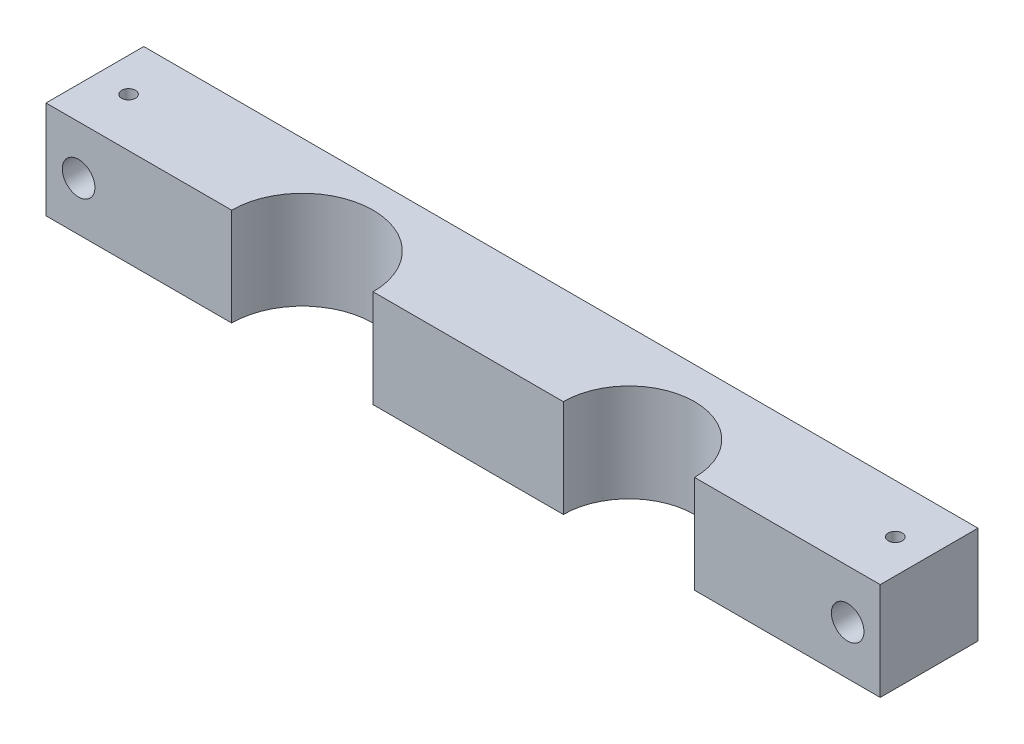
ISO-10303-21;
HEADER;
FILE_DESCRIPTION(('STEP AP214'),'2;1');
FILE_NAME('part.step','',(''),(''),'','','');
FILE_SCHEMA(('AUTOMOTIVE_DESIGN { 1 0 10303 214 1 1 1 1 }'));
ENDSEC;
DATA;
#1=APPLICATION_CONTEXT('core data for automotive mechanical design processes');
#2=APPLICATION_PROTOCOL_DEFINITION('international standard','automotive_design',2000,#1);
#3=PRODUCT_CONTEXT('',#1,'mechanical');
#4=PRODUCT('Part','Part','',(#3));
#5=PRODUCT_RELATED_PRODUCT_CATEGORY('part','',(#4));
#6=PRODUCT_DEFINITION_FORMATION('','',#4);
#7=PRODUCT_DEFINITION_CONTEXT('part definition',#1,'design');
#8=PRODUCT_DEFINITION('design','',#6,#7);
#9=PRODUCT_DEFINITION_SHAPE('','',#8);
#10=(LENGTH_UNIT() NAMED_UNIT(*) SI_UNIT(.MILLI.,.METRE.));
#11=(NAMED_UNIT(*) PLANE_ANGLE_UNIT() SI_UNIT($,.RADIAN.));
#12=(NAMED_UNIT(*) SI_UNIT($,.STERADIAN.) SOLID_ANGLE_UNIT());
#13=UNCERTAINTY_MEASURE_WITH_UNIT(LENGTH_MEASURE(1.E-05),#10,'distance_accuracy_value','');
#14=(GEOMETRIC_REPRESENTATION_CONTEXT(3) GLOBAL_UNCERTAINTY_ASSIGNED_CONTEXT((#13)) GLOBAL_UNIT_ASSIGNED_CONTEXT((#10,
#11,#12)) REPRESENTATION_CONTEXT('',''));
#15=CARTESIAN_POINT('',(0.,0.,0.));
#16=DIRECTION('',(0.,0.,1.));
#17=DIRECTION('',(1.,0.,0.));
#18=AXIS2_PLACEMENT_3D('',#15,#16,#17);
#19=CARTESIAN_POINT('',(0.,19.05,0.));
#20=DIRECTION('',(0.,0.,-1.));
#21=DIRECTION('',(-1.,0.,0.));
#22=AXIS2_PLACEMENT_3D('',#19,#20,#21);
#23=PLANE('',#22);
#24=CARTESIAN_POINT('',(6.35000000000001,9.525,0.));
#25=DIRECTION('',(0.,0.,1.));
#26=DIRECTION('',(1.,0.,0.));
#27=AXIS2_PLACEMENT_3D('',#24,#25,#26);
#28=CIRCLE('',#27,3.175);
#29=CARTESIAN_POINT('',(9.52500000000001,9.525,0.));
#30=VERTEX_POINT('',#29);
#31=EDGE_CURVE('E191',#30,#30,#28,.T.);
#32=ORIENTED_EDGE('',*,*,#31,.F.);
#33=EDGE_LOOP('',(#32));
#34=FACE_BOUND('',#33,.T.);
#35=DIRECTION('',(1.,0.,0.));
#36=VECTOR('',#35,1.);
#37=CARTESIAN_POINT('',(0.,0.,0.));
#38=LINE('',#37,#36);
#39=CARTESIAN_POINT('',(0.,0.,0.));
#40=VERTEX_POINT('',#39);
#41=CARTESIAN_POINT('',(36.17595,0.,0.));
#42=VERTEX_POINT('',#41);
#43=EDGE_CURVE('E131',#40,#42,#38,.T.);
#44=ORIENTED_EDGE('',*,*,#43,.T.);
#45=DIRECTION('',(0.,-1.,0.));
#46=VECTOR('',#45,1.);
#47=CARTESIAN_POINT('',(36.17595,19.05,0.));
#48=LINE('',#47,#46);
#49=CARTESIAN_POINT('',(36.17595,19.05,0.));
#50=VERTEX_POINT('',#49);
#51=EDGE_CURVE('E11',#50,#42,#48,.T.);
#52=ORIENTED_EDGE('',*,*,#51,.F.);
#53=DIRECTION('',(1.,0.,0.));
#54=VECTOR('',#53,1.);
#55=CARTESIAN_POINT('',(0.,19.05,0.));
#56=LINE('',#55,#54);
#57=CARTESIAN_POINT('',(0.,19.05,0.));
#58=VERTEX_POINT('',#57);
#59=EDGE_CURVE('E88',#58,#50,#56,.T.);
#60=ORIENTED_EDGE('',*,*,#59,.F.);
#61=DIRECTION('',(0.,-1.,0.));
#62=VECTOR('',#61,1.);
#63=CARTESIAN_POINT('',(0.,19.05,0.));
#64=LINE('',#63,#62);
#65=EDGE_CURVE('E51',#58,#40,#64,.T.);
#66=ORIENTED_EDGE('',*,*,#65,.T.);
#67=EDGE_LOOP('',(#44,#52,#60,#66));
#68=FACE_BOUND('',#67,.T.);
#69=ADVANCED_FACE('F35',(#34,#68),#23,.F.);
#70=CARTESIAN_POINT('',(49.95545,19.05,0.));
#71=DIRECTION('',(0.,-1.,0.));
#72=DIRECTION('',(0.,0.,-1.));
#73=AXIS2_PLACEMENT_3D('',#70,#71,#72);
#74=CYLINDRICAL_SURFACE('',#73,13.7795);
#75=CARTESIAN_POINT('',(49.95545,0.,0.));
#76=DIRECTION('',(0.,1.,0.));
#77=DIRECTION('',(0.,0.,1.));
#78=AXIS2_PLACEMENT_3D('',#75,#76,#77);
#79=CIRCLE('',#78,13.7795);
#80=CARTESIAN_POINT('',(63.73495,0.,0.));
#81=VERTEX_POINT('',#80);
#82=EDGE_CURVE('E133',#81,#42,#79,.T.);
#83=ORIENTED_EDGE('',*,*,#82,.F.);
#84=DIRECTION('',(0.,-1.,0.));
#85=VECTOR('',#84,1.);
#86=CARTESIAN_POINT('',(63.73495,19.05,0.));
#87=LINE('',#86,#85);
#88=CARTESIAN_POINT('',(63.73495,19.05,0.));
#89=VERTEX_POINT('',#88);
#90=EDGE_CURVE('E43',#89,#81,#87,.T.);
#91=ORIENTED_EDGE('',*,*,#90,.F.);
#92=CARTESIAN_POINT('',(49.95545,19.05,0.));
#93=DIRECTION('',(0.,1.,0.));
#94=DIRECTION('',(0.,0.,1.));
#95=AXIS2_PLACEMENT_3D('',#92,#93,#94);
#96=CIRCLE('',#95,13.7795);
#97=EDGE_CURVE('E171',#89,#50,#96,.T.);
#98=ORIENTED_EDGE('',*,*,#97,.T.);
#99=ORIENTED_EDGE('',*,*,#51,.T.);
#100=EDGE_LOOP('',(#83,#91,#98,#99));
#101=FACE_BOUND('',#100,.T.);
#102=ADVANCED_FACE('F170',(#101),#74,.F.);
#103=CARTESIAN_POINT('',(63.73495,19.05,0.));
#104=DIRECTION('',(0.,0.,-1.));
#105=DIRECTION('',(-1.,0.,0.));
#106=AXIS2_PLACEMENT_3D('',#103,#104,#105);
#107=PLANE('',#106);
#108=DIRECTION('',(1.,0.,0.));
#109=VECTOR('',#108,1.);
#110=CARTESIAN_POINT('',(63.73495,0.,0.));
#111=LINE('',#110,#109);
#112=CARTESIAN_POINT('',(100.80625,0.,0.));
#113=VERTEX_POINT('',#112);
#114=EDGE_CURVE('E137',#81,#113,#111,.T.);
#115=ORIENTED_EDGE('',*,*,#114,.T.);
#116=DIRECTION('',(0.,-1.,0.));
#117=VECTOR('',#116,1.);
#118=CARTESIAN_POINT('',(100.80625,19.05,0.));
#119=LINE('',#118,#117);
#120=CARTESIAN_POINT('',(100.80625,19.05,0.));
#121=VERTEX_POINT('',#120);
#122=EDGE_CURVE('E156',#121,#113,#119,.T.);
#123=ORIENTED_EDGE('',*,*,#122,.F.);
#124=DIRECTION('',(1.,0.,0.));
#125=VECTOR('',#124,1.);
#126=CARTESIAN_POINT('',(63.73495,19.05,0.));
#127=LINE('',#126,#125);
#128=EDGE_CURVE('E162',#89,#121,#127,.T.);
#129=ORIENTED_EDGE('',*,*,#128,.F.);
#130=ORIENTED_EDGE('',*,*,#90,.T.);
#131=EDGE_LOOP('',(#115,#123,#129,#130));
#132=FACE_BOUND('',#131,.T.);
#133=ADVANCED_FACE('F160',(#132),#107,.F.);
#134=CARTESIAN_POINT('',(113.59515,19.05,0.));
#135=DIRECTION('',(0.,-1.,0.));
#136=DIRECTION('',(0.,0.,-1.));
#137=AXIS2_PLACEMENT_3D('',#134,#135,#136);
#138=CYLINDRICAL_SURFACE('',#137,12.7889);
#139=CARTESIAN_POINT('',(113.59515,0.,0.));
#140=DIRECTION('',(0.,1.,0.));
#141=DIRECTION('',(0.,0.,1.));
#142=AXIS2_PLACEMENT_3D('',#139,#140,#141);
#143=CIRCLE('',#142,12.7889);
#144=CARTESIAN_POINT('',(126.38405,0.,0.));
#145=VERTEX_POINT('',#144);
#146=EDGE_CURVE('E140',#145,#113,#143,.T.);
#147=ORIENTED_EDGE('',*,*,#146,.F.);
#148=DIRECTION('',(0.,-1.,0.));
#149=VECTOR('',#148,1.);
#150=CARTESIAN_POINT('',(126.38405,19.05,0.));
#151=LINE('',#150,#149);
#152=CARTESIAN_POINT('',(126.38405,19.05,0.));
#153=VERTEX_POINT('',#152);
#154=EDGE_CURVE('E154',#153,#145,#151,.T.);
#155=ORIENTED_EDGE('',*,*,#154,.F.);
#156=CARTESIAN_POINT('',(113.59515,19.05,0.));
#157=DIRECTION('',(0.,1.,0.));
#158=DIRECTION('',(0.,0.,1.));
#159=AXIS2_PLACEMENT_3D('',#156,#157,#158);
#160=CIRCLE('',#159,12.7889);
#161=EDGE_CURVE('E209',#153,#121,#160,.T.);
#162=ORIENTED_EDGE('',*,*,#161,.T.);
#163=ORIENTED_EDGE('',*,*,#122,.T.);
#164=EDGE_LOOP('',(#147,#155,#162,#163));
#165=FACE_BOUND('',#164,.T.);
#166=ADVANCED_FACE('F212',(#165),#138,.F.);
#167=CARTESIAN_POINT('',(126.38405,19.05,0.));
#168=DIRECTION('',(0.,0.,-1.));
#169=DIRECTION('',(-1.,0.,0.));
#170=AXIS2_PLACEMENT_3D('',#167,#168,#169);
#171=PLANE('',#170);
#172=CARTESIAN_POINT('',(156.21,9.525,0.));
#173=DIRECTION('',(0.,0.,1.));
#174=DIRECTION('',(1.,0.,0.));
#175=AXIS2_PLACEMENT_3D('',#172,#173,#174);
#176=CIRCLE('',#175,3.17500000000001);
#177=CARTESIAN_POINT('',(159.385,9.525,0.));
#178=VERTEX_POINT('',#177);
#179=EDGE_CURVE('E331',#178,#178,#176,.T.);
#180=ORIENTED_EDGE('',*,*,#179,.F.);
#181=EDGE_LOOP('',(#180));
#182=FACE_BOUND('',#181,.T.);
#183=DIRECTION('',(1.,0.,0.));
#184=VECTOR('',#183,1.);
#185=CARTESIAN_POINT('',(126.38405,0.,0.));
#186=LINE('',#185,#184);
#187=CARTESIAN_POINT('',(162.56,0.,0.));
#188=VERTEX_POINT('',#187);
#189=EDGE_CURVE('E143',#145,#188,#186,.T.);
#190=ORIENTED_EDGE('',*,*,#189,.T.);
#191=DIRECTION('',(0.,-1.,0.));
#192=VECTOR('',#191,1.);
#193=CARTESIAN_POINT('',(162.56,19.05,0.));
#194=LINE('',#193,#192);
#195=CARTESIAN_POINT('',(162.56,19.05,0.));
#196=VERTEX_POINT('',#195);
#197=EDGE_CURVE('E123',#196,#188,#194,.T.);
#198=ORIENTED_EDGE('',*,*,#197,.F.);
#199=DIRECTION('',(1.,0.,0.));
#200=VECTOR('',#199,1.);
#201=CARTESIAN_POINT('',(126.38405,19.05,0.));
#202=LINE('',#201,#200);
#203=EDGE_CURVE('E111',#153,#196,#202,.T.);
#204=ORIENTED_EDGE('',*,*,#203,.F.);
#205=ORIENTED_EDGE('',*,*,#154,.T.);
#206=EDGE_LOOP('',(#190,#198,#204,#205));
#207=FACE_BOUND('',#206,.T.);
#208=ADVANCED_FACE('F214',(#182,#207),#171,.F.);
#209=CARTESIAN_POINT('',(162.56,19.05,0.));
#210=DIRECTION('',(-1.,0.,0.));
#211=DIRECTION('',(0.,0.,1.));
#212=AXIS2_PLACEMENT_3D('',#209,#210,#211);
#213=PLANE('',#212);
#214=DIRECTION('',(0.,0.,-1.));
#215=VECTOR('',#214,1.);
#216=CARTESIAN_POINT('',(162.56,0.,0.));
#217=LINE('',#216,#215);
#218=CARTESIAN_POINT('',(162.56,0.,-19.05));
#219=VERTEX_POINT('',#218);
#220=EDGE_CURVE('E120',#188,#219,#217,.T.);
#221=ORIENTED_EDGE('',*,*,#220,.T.);
#222=DIRECTION('',(0.,-1.,0.));
#223=VECTOR('',#222,1.);
#224=CARTESIAN_POINT('',(162.56,19.05,-19.05));
#225=LINE('',#224,#223);
#226=CARTESIAN_POINT('',(162.56,19.05,-19.05));
#227=VERTEX_POINT('',#226);
#228=EDGE_CURVE('E117',#227,#219,#225,.T.);
#229=ORIENTED_EDGE('',*,*,#228,.F.);
#230=DIRECTION('',(0.,0.,-1.));
#231=VECTOR('',#230,1.);
#232=CARTESIAN_POINT('',(162.56,19.05,0.));
#233=LINE('',#232,#231);
#234=EDGE_CURVE('E104',#196,#227,#233,.T.);
#235=ORIENTED_EDGE('',*,*,#234,.F.);
#236=ORIENTED_EDGE('',*,*,#197,.T.);
#237=EDGE_LOOP('',(#221,#229,#235,#236));
#238=FACE_BOUND('',#237,.T.);
#239=ADVANCED_FACE('F118',(#238),#213,.F.);
#240=CARTESIAN_POINT('',(0.,19.05,-19.05));
#241=DIRECTION('',(0.,0.,-1.));
#242=DIRECTION('',(-1.,0.,0.));
#243=AXIS2_PLACEMENT_3D('',#240,#241,#242);
#244=PLANE('',#243);
#245=CARTESIAN_POINT('',(156.21,9.525,-19.05));
#246=DIRECTION('',(0.,0.,1.));
#247=DIRECTION('',(1.,0.,0.));
#248=AXIS2_PLACEMENT_3D('',#245,#246,#247);
#249=CIRCLE('',#248,3.17499999999998);
#250=CARTESIAN_POINT('',(159.385,9.525,-19.05));
#251=VERTEX_POINT('',#250);
#252=EDGE_CURVE('E335',#251,#251,#249,.T.);
#253=ORIENTED_EDGE('',*,*,#252,.T.);
#254=EDGE_LOOP('',(#253));
#255=FACE_BOUND('',#254,.T.);
#256=CARTESIAN_POINT('',(6.35000000000001,9.525,-19.05));
#257=DIRECTION('',(0.,0.,1.));
#258=DIRECTION('',(1.,0.,0.));
#259=AXIS2_PLACEMENT_3D('',#256,#257,#258);
#260=CIRCLE('',#259,3.175);
#261=CARTESIAN_POINT('',(9.525,9.525,-19.05));
#262=VERTEX_POINT('',#261);
#263=EDGE_CURVE('E134',#262,#262,#260,.T.);
#264=ORIENTED_EDGE('',*,*,#263,.T.);
#265=EDGE_LOOP('',(#264));
#266=FACE_BOUND('',#265,.T.);
#267=DIRECTION('',(1.,0.,0.));
#268=VECTOR('',#267,1.);
#269=CARTESIAN_POINT('',(0.,0.,-19.05));
#270=LINE('',#269,#268);
#271=CARTESIAN_POINT('',(0.,0.,-19.05));
#272=VERTEX_POINT('',#271);
#273=EDGE_CURVE('E146',#272,#219,#270,.T.);
#274=ORIENTED_EDGE('',*,*,#273,.F.);
#275=DIRECTION('',(0.,-1.,0.));
#276=VECTOR('',#275,1.);
#277=CARTESIAN_POINT('',(0.,19.05,-19.05));
#278=LINE('',#277,#276);
#279=CARTESIAN_POINT('',(0.,19.05,-19.05));
#280=VERTEX_POINT('',#279);
#281=EDGE_CURVE('E76',#280,#272,#278,.T.);
#282=ORIENTED_EDGE('',*,*,#281,.F.);
#283=DIRECTION('',(1.,0.,0.));
#284=VECTOR('',#283,1.);
#285=CARTESIAN_POINT('',(0.,19.05,-19.05));
#286=LINE('',#285,#284);
#287=EDGE_CURVE('E108',#280,#227,#286,.T.);
#288=ORIENTED_EDGE('',*,*,#287,.T.);
#289=ORIENTED_EDGE('',*,*,#228,.T.);
#290=EDGE_LOOP('',(#274,#282,#288,#289));
#291=FACE_BOUND('',#290,.T.);
#292=ADVANCED_FACE('F125',(#255,#266,#291),#244,.T.);
#293=CARTESIAN_POINT('',(0.,19.05,0.));
#294=DIRECTION('',(-1.,0.,0.));
#295=DIRECTION('',(0.,0.,1.));
#296=AXIS2_PLACEMENT_3D('',#293,#294,#295);
#297=PLANE('',#296);
#298=DIRECTION('',(0.,0.,-1.));
#299=VECTOR('',#298,1.);
#300=CARTESIAN_POINT('',(0.,0.,0.));
#301=LINE('',#300,#299);
#302=EDGE_CURVE('E148',#40,#272,#301,.T.);
#303=ORIENTED_EDGE('',*,*,#302,.F.);
#304=ORIENTED_EDGE('',*,*,#65,.F.);
#305=DIRECTION('',(0.,0.,-1.));
#306=VECTOR('',#305,1.);
#307=CARTESIAN_POINT('',(0.,19.05,0.));
#308=LINE('',#307,#306);
#309=EDGE_CURVE('E126',#58,#280,#308,.T.);
#310=ORIENTED_EDGE('',*,*,#309,.T.);
#311=ORIENTED_EDGE('',*,*,#281,.T.);
#312=EDGE_LOOP('',(#303,#304,#310,#311));
#313=FACE_BOUND('',#312,.T.);
#314=ADVANCED_FACE('F172',(#313),#297,.T.);
#315=CARTESIAN_POINT('',(49.95545,19.05,0.));
#316=DIRECTION('',(0.,1.,0.));
#317=DIRECTION('',(0.,0.,1.));
#318=AXIS2_PLACEMENT_3D('',#315,#316,#317);
#319=PLANE('',#318);
#320=CARTESIAN_POINT('',(155.98107677662,19.05,-9.50876156883329));
#321=DIRECTION('',(0.,1.,0.));
#322=DIRECTION('',(0.,0.,1.));
#323=AXIS2_PLACEMENT_3D('',#320,#321,#322);
#324=CIRCLE('',#323,1.35254999999998);
#325=CARTESIAN_POINT('',(155.98107677662,19.05,-8.15621156883331));
#326=VERTEX_POINT('',#325);
#327=EDGE_CURVE('E332',#326,#326,#324,.T.);
#328=ORIENTED_EDGE('',*,*,#327,.F.);
#329=EDGE_LOOP('',(#328));
#330=FACE_BOUND('',#329,.T.);
#331=CARTESIAN_POINT('',(6.57892322337972,19.05,-9.50876156883329));
#332=DIRECTION('',(0.,1.,0.));
#333=DIRECTION('',(0.,0.,1.));
#334=AXIS2_PLACEMENT_3D('',#331,#332,#333);
#335=CIRCLE('',#334,1.35254999999999);
#336=CARTESIAN_POINT('',(6.57892322337972,19.05,-8.1562115688333));
#337=VERTEX_POINT('',#336);
#338=EDGE_CURVE('E198',#337,#337,#335,.T.);
#339=ORIENTED_EDGE('',*,*,#338,.F.);
#340=EDGE_LOOP('',(#339));
#341=FACE_BOUND('',#340,.T.);
#342=ORIENTED_EDGE('',*,*,#59,.T.);
#343=ORIENTED_EDGE('',*,*,#97,.F.);
#344=ORIENTED_EDGE('',*,*,#128,.T.);
#345=ORIENTED_EDGE('',*,*,#161,.F.);
#346=ORIENTED_EDGE('',*,*,#203,.T.);
#347=ORIENTED_EDGE('',*,*,#234,.T.);
#348=ORIENTED_EDGE('',*,*,#287,.F.);
#349=ORIENTED_EDGE('',*,*,#309,.F.);
#350=EDGE_LOOP('',(#342,#343,#344,#345,#346,#347,#348,#349));
#351=FACE_BOUND('',#350,.T.);
#352=ADVANCED_FACE('F106',(#330,#341,#351),#319,.T.);
#353=CARTESIAN_POINT('',(49.95545,0.,0.));
#354=DIRECTION('',(0.,1.,0.));
#355=DIRECTION('',(0.,0.,1.));
#356=AXIS2_PLACEMENT_3D('',#353,#354,#355);
#357=PLANE('',#356);
#358=ORIENTED_EDGE('',*,*,#43,.F.);
#359=ORIENTED_EDGE('',*,*,#302,.T.);
#360=ORIENTED_EDGE('',*,*,#273,.T.);
#361=ORIENTED_EDGE('',*,*,#220,.F.);
#362=ORIENTED_EDGE('',*,*,#189,.F.);
#363=ORIENTED_EDGE('',*,*,#146,.T.);
#364=ORIENTED_EDGE('',*,*,#114,.F.);
#365=ORIENTED_EDGE('',*,*,#82,.T.);
#366=EDGE_LOOP('',(#358,#359,#360,#361,#362,#363,#364,#365));
#367=FACE_BOUND('',#366,.T.);
#368=ADVANCED_FACE('F167',(#367),#357,.F.);
#369=CARTESIAN_POINT('',(6.35000000000001,9.525,0.));
#370=DIRECTION('',(0.,0.,1.));
#371=DIRECTION('',(1.,0.,0.));
#372=AXIS2_PLACEMENT_3D('',#369,#370,#371);
#373=CYLINDRICAL_SURFACE('',#372,3.175);
#374=CARTESIAN_POINT('',(6.57892322337972,12.6917363574819,-8.1562115688333));
#375=CARTESIAN_POINT('',(6.65255247924732,12.6864077459737,-8.15621929306368));
#376=CARTESIAN_POINT('',(6.72611555658081,12.6784838367294,-8.16226054581655));
#377=CARTESIAN_POINT('',(6.8707611335554,12.6578594868522,-8.18602700860501));
#378=CARTESIAN_POINT('',(6.94183602201496,12.6451455888513,-8.20378524384766));
#379=CARTESIAN_POINT('',(7.07920122890044,12.6159220073187,-8.25005543262345));
#380=CARTESIAN_POINT('',(7.14551049556134,12.5994285899449,-8.27852162907786));
#381=CARTESIAN_POINT('',(7.27220003196033,12.5638332677158,-8.34519522887049));
#382=CARTESIAN_POINT('',(7.33258225951235,12.5447322292256,-8.38339940047028));
#383=CARTESIAN_POINT('',(7.44985989844767,12.5040966803686,-8.47119196862278));
#384=CARTESIAN_POINT('',(7.50631290112532,12.4824847595783,-8.52133574531964));
#385=CARTESIAN_POINT('',(7.61023952302547,12.4397187784605,-8.63043368132597));
#386=CARTESIAN_POINT('',(7.65770670380062,12.4185650559761,-8.68939410413072));
#387=CARTESIAN_POINT('',(7.74444200405213,12.3778161794392,-8.81793519893404));
#388=CARTESIAN_POINT('',(7.78322815912057,12.3583386997448,-8.88788143838436));
#389=CARTESIAN_POINT('',(7.84815135523137,12.3245570134792,-9.03456169987672));
#390=CARTESIAN_POINT('',(7.87430153404176,12.3102474377079,-9.11128857337793));
#391=CARTESIAN_POINT('',(7.91091728398727,12.2898811557393,-9.26239518482455));
#392=CARTESIAN_POINT('',(7.92253566602218,12.2832219128555,-9.33641187728437));
#393=CARTESIAN_POINT('',(7.93333783703561,12.2770378289333,-9.48562205719568));
#394=CARTESIAN_POINT('',(7.93253086906877,12.2775076846484,-9.56081462833266));
#395=CARTESIAN_POINT('',(7.91932395141996,12.2850520411748,-9.70155090625888));
#396=CARTESIAN_POINT('',(7.90818748982233,12.2914066009858,-9.76725850268121));
#397=CARTESIAN_POINT('',(7.87662489050855,12.3089476744592,-9.89572260789425));
#398=CARTESIAN_POINT('',(7.85619624586791,12.320135492038,-9.95847831525441));
#399=CARTESIAN_POINT('',(7.80591031501602,12.3466630073887,-10.0819100300372));
#400=CARTESIAN_POINT('',(7.77573580946329,12.3621394656623,-10.1424262786639));
#401=CARTESIAN_POINT('',(7.70711954923305,12.395593538895,-10.2578114259492));
#402=CARTESIAN_POINT('',(7.66867402109168,12.4135722941434,-10.31267773));
#403=CARTESIAN_POINT('',(7.57909717429143,12.4529037375524,-10.4223577275418));
#404=CARTESIAN_POINT('',(7.52698390316058,12.4743983338384,-10.4763210437221));
#405=CARTESIAN_POINT('',(7.41443107629271,12.5168606987678,-10.5750283652219));
#406=CARTESIAN_POINT('',(7.35398760167575,12.5378282139279,-10.6197680064627));
#407=CARTESIAN_POINT('',(7.22257590403941,12.5785562989504,-10.7009752924364));
#408=CARTESIAN_POINT('',(7.15122107877405,12.5981951802655,-10.7368833194981));
#409=CARTESIAN_POINT('',(7.00239212005326,12.633188862566,-10.7957967908199));
#410=CARTESIAN_POINT('',(6.92492157621792,12.6485461529912,-10.8188097405416));
#411=CARTESIAN_POINT('',(6.77147069143594,12.6727958292307,-10.8496684854442));
#412=CARTESIAN_POINT('',(6.69572903224841,12.6820477855848,-10.8584144758722));
#413=CARTESIAN_POINT('',(6.54339660296968,12.6950244882796,-10.8629873038183));
#414=CARTESIAN_POINT('',(6.46680626307379,12.6987519164916,-10.8588204129074));
#415=CARTESIAN_POINT('',(6.32102318025413,12.7006430020178,-10.8383827011602));
#416=CARTESIAN_POINT('',(6.25170365644628,12.6991995260605,-10.8230343472604));
#417=CARTESIAN_POINT('',(6.11651674243009,12.6921270147551,-10.7817763110629));
#418=CARTESIAN_POINT('',(6.05064949652286,12.6864978045974,-10.7558661876925));
#419=CARTESIAN_POINT('',(5.92350372791114,12.6718812947187,-10.6940296162342));
#420=CARTESIAN_POINT('',(5.86227035413398,12.6628650684564,-10.658017584612));
#421=CARTESIAN_POINT('',(5.74640795634596,12.6426538527673,-10.577081729416));
#422=CARTESIAN_POINT('',(5.69178113304946,12.631458140553,-10.53215494933));
#423=CARTESIAN_POINT('',(5.58703836889164,12.6074639986362,-10.4313496094551));
#424=CARTESIAN_POINT('',(5.5374300019218,12.5946089267053,-10.3749563722179));
#425=CARTESIAN_POINT('',(5.44813901947559,12.5695734734826,-10.2546389716585));
#426=CARTESIAN_POINT('',(5.40845887603387,12.5573932608109,-10.1907129385574));
#427=CARTESIAN_POINT('',(5.33919383123497,12.5350268918784,-10.0550349345448));
#428=CARTESIAN_POINT('',(5.30990757505299,12.5249028364673,-9.98311928939017));
#429=CARTESIAN_POINT('',(5.26400538060467,12.5085956276692,-9.83493725203835));
#430=CARTESIAN_POINT('',(5.24738280465214,12.502410410014,-9.7586731616484));
#431=CARTESIAN_POINT('',(5.22800046635968,12.4951588977572,-9.60809592942393));
#432=CARTESIAN_POINT('',(5.22458206992478,12.4938495195956,-9.5338792079319));
#433=CARTESIAN_POINT('',(5.2299287630517,12.4958708779256,-9.38595785239721));
#434=CARTESIAN_POINT('',(5.23869217887121,12.499200976968,-9.31225314940311));
#435=CARTESIAN_POINT('',(5.26750620920061,12.5098035804153,-9.17016697805939));
#436=CARTESIAN_POINT('',(5.28714195214333,12.5169308337085,-9.10168940261084));
#437=CARTESIAN_POINT('',(5.33673303352226,12.5340861572024,-8.96896803926017));
#438=CARTESIAN_POINT('',(5.36669105989655,12.5441149828678,-8.90472535932735));
#439=CARTESIAN_POINT('',(5.43764400321008,12.5663269713309,-8.77917111233599));
#440=CARTESIAN_POINT('',(5.47907084351354,12.5785861585438,-8.71811730602372));
#441=CARTESIAN_POINT('',(5.5712470131018,12.6033832497709,-8.60356112981438));
#442=CARTESIAN_POINT('',(5.62199847999045,12.6159212171131,-8.55006049641139));
#443=CARTESIAN_POINT('',(5.7342493532861,12.6402721778273,-8.4495875349231));
#444=CARTESIAN_POINT('',(5.7961386720564,12.65202439029,-8.40303420777947));
#445=CARTESIAN_POINT('',(5.92736838485786,12.672444633188,-8.32096837801094));
#446=CARTESIAN_POINT('',(5.99671091159077,12.6811117777699,-8.28545904695354));
#447=CARTESIAN_POINT('',(6.13856075754533,12.6937271021522,-8.2276854229821));
#448=CARTESIAN_POINT('',(6.21090067579417,12.6978147217595,-8.2050407486056));
#449=CARTESIAN_POINT('',(6.3583205273436,12.7008384511387,-8.17220087277401));
#450=CARTESIAN_POINT('',(6.43339175163695,12.6997897165033,-8.16196915634397));
#451=CARTESIAN_POINT('',(6.53198724796809,12.6948690865519,-8.15681941614037));
#452=CARTESIAN_POINT('',(6.55545859624927,12.693434512389,-8.15620910722774));
#453=CARTESIAN_POINT('',(6.57892322337972,12.6917363574819,-8.1562115688333));
#454=B_SPLINE_CURVE_WITH_KNOTS('',3,(#374,#375,#376,#377,#378,#379,#380,#381,#382,#383,#384,
#385,#386,#387,#388,#389,#390,#391,#392,#393,#394,#395,#396,#397,#398,#399,#400,#401,#402,#403,
#404,#405,#406,#407,#408,#409,#410,#411,#412,#413,#414,#415,#416,#417,#418,#419,#420,#421,#422,
#423,#424,#425,#426,#427,#428,#429,#430,#431,#432,#433,#434,#435,#436,#437,#438,#439,#440,#441,
#442,#443,#444,#445,#446,#447,#448,#449,#450,#451,#452,#453),.UNSPECIFIED.,.T.,.F.,(4,2,2,2,2,2,
2,2,2,2,2,2,2,2,2,2,2,2,2,2,2,2,2,2,2,2,2,2,2,2,2,2,2,2,2,2,2,2,2,4),(0.,0.221399171253234,
0.443425054041141,0.664512762969983,0.885527194911249,1.12012568615773,1.35489163898706,
1.60053830623307,1.84592901934976,2.07027441807772,2.29445293727846,2.49438143505242,
2.69436390326501,2.90165303848445,3.10903694591891,3.34213993912772,3.57535297056838,
3.82084606492922,4.06619612346776,4.29536506278778,4.52442271602544,4.73645883523433,
4.94850381024404,5.16240250330651,5.37637225325213,5.60394522165162,5.83157479732572,
6.06529726133362,6.29889713492991,6.52068192726504,6.74243625008589,6.95625998906308,
7.17013945019548,7.39353925885623,7.6169903443667,7.85082710714226,8.08473096028529,
8.3113008898576,8.5372026939396,8.60775955261257),.UNSPECIFIED.);
#455=CARTESIAN_POINT('',(6.57892322337972,12.6917363574819,-8.1562115688333));
#456=VERTEX_POINT('',#455);
#457=EDGE_CURVE('E193',#456,#456,#454,.T.);
#458=ORIENTED_EDGE('',*,*,#457,.T.);
#459=EDGE_LOOP('',(#458));
#460=FACE_BOUND('',#459,.T.);
#461=ORIENTED_EDGE('',*,*,#263,.F.);
#462=EDGE_LOOP('',(#461));
#463=FACE_BOUND('',#462,.T.);
#464=ORIENTED_EDGE('',*,*,#31,.T.);
#465=EDGE_LOOP('',(#464));
#466=FACE_BOUND('',#465,.T.);
#467=ADVANCED_FACE('F256',(#460,#463,#466),#373,.F.);
#468=CARTESIAN_POINT('',(6.57892322337972,19.05,-9.50876156883329));
#469=DIRECTION('',(0.,1.,0.));
#470=DIRECTION('',(0.,0.,1.));
#471=AXIS2_PLACEMENT_3D('',#468,#469,#470);
#472=CYLINDRICAL_SURFACE('',#471,1.35254999999999);
#473=ORIENTED_EDGE('',*,*,#457,.F.);
#474=EDGE_LOOP('',(#473));
#475=FACE_BOUND('',#474,.T.);
#476=ORIENTED_EDGE('',*,*,#338,.T.);
#477=EDGE_LOOP('',(#476));
#478=FACE_BOUND('',#477,.T.);
#479=ADVANCED_FACE('F270',(#475,#478),#472,.F.);
#480=CARTESIAN_POINT('',(156.21,9.525,0.));
#481=DIRECTION('',(0.,0.,1.));
#482=DIRECTION('',(1.,0.,0.));
#483=AXIS2_PLACEMENT_3D('',#480,#481,#482);
#484=CYLINDRICAL_SURFACE('',#483,3.175);
#485=CARTESIAN_POINT('',(155.98107677662,12.6917363574819,-8.1562115688333));
#486=CARTESIAN_POINT('',(156.052291573034,12.6968782080331,-8.15621976930081));
#487=CARTESIAN_POINT('',(156.123771358722,12.6996104197209,-8.16186715451244));
#488=CARTESIAN_POINT('',(156.265067472922,12.700313130347,-8.18441923535912));
#489=CARTESIAN_POINT('',(156.334879718088,12.6982729528443,-8.20134911078767));
#490=CARTESIAN_POINT('',(156.470545636955,12.6900191934026,-8.24587079099821));
#491=CARTESIAN_POINT('',(156.536409131236,12.6838164763683,-8.27343475964611));
#492=CARTESIAN_POINT('',(156.662661653333,12.6682108727926,-8.33834488150089));
#493=CARTESIAN_POINT('',(156.723051917231,12.6588087111101,-8.37568881853944));
#494=CARTESIAN_POINT('',(156.838999712731,12.6376480600764,-8.46057366486733));
#495=CARTESIAN_POINT('',(156.894320026877,12.6258197328296,-8.50842074089327));
#496=CARTESIAN_POINT('',(156.996496838495,12.6014934171899,-8.61230935545595));
#497=CARTESIAN_POINT('',(157.043349625837,12.5889951383461,-8.66835446667681));
#498=CARTESIAN_POINT('',(157.129796443635,12.5641995094323,-8.79061376705772));
#499=CARTESIAN_POINT('',(157.168860215064,12.551949664016,-8.85721421339177));
#500=CARTESIAN_POINT('',(157.235218597005,12.5301255398928,-8.99645023777269));
#501=CARTESIAN_POINT('',(157.262516063426,12.5205506121306,-9.06908434622276));
#502=CARTESIAN_POINT('',(157.30389157555,12.5056885265959,-9.21670814877946));
#503=CARTESIAN_POINT('',(157.318249568352,12.5003109219984,-9.29160978477192));
#504=CARTESIAN_POINT('',(157.334162290652,12.4943368629823,-9.44293585809156));
#505=CARTESIAN_POINT('',(157.335722471428,12.4937383728838,-9.51935963315044));
#506=CARTESIAN_POINT('',(157.326266935797,12.4973039881575,-9.66689632597075));
#507=CARTESIAN_POINT('',(157.315965013958,12.5011977986242,-9.73806310069285));
#508=CARTESIAN_POINT('',(157.284335602887,12.5127597159742,-9.87757882230763));
#509=CARTESIAN_POINT('',(157.263006466138,12.5204283868308,-9.94592734649266));
#510=CARTESIAN_POINT('',(157.209693932447,12.5386415132897,-10.0789296095873));
#511=CARTESIAN_POINT('',(157.177578674512,12.5492212523748,-10.1435254050517));
#512=CARTESIAN_POINT('',(157.103657838961,12.5718823242964,-10.2666284215806));
#513=CARTESIAN_POINT('',(157.061848980832,12.5839641648316,-10.3251335717114));
#514=CARTESIAN_POINT('',(156.966719158607,12.6089192172874,-10.438102951738));
#515=CARTESIAN_POINT('',(156.91285635948,12.6217962515579,-10.4921113398419));
#516=CARTESIAN_POINT('',(156.796600641259,12.6459043397083,-10.5904775769876));
#517=CARTESIAN_POINT('',(156.734207202558,12.6571352932381,-10.6348348377467));
#518=CARTESIAN_POINT('',(156.602215140882,12.6763884073219,-10.7126993182426));
#519=CARTESIAN_POINT('',(156.532593190322,12.6843997453874,-10.7461698724669));
#520=CARTESIAN_POINT('',(156.388340909703,12.6958107601356,-10.8008405414983));
#521=CARTESIAN_POINT('',(156.31371330315,12.6992129235841,-10.8220472694059));
#522=CARTESIAN_POINT('',(156.166608913192,12.7005022682289,-10.8504881022912));
#523=CARTESIAN_POINT('',(156.094286367152,12.6987188160067,-10.8585081393893));
#524=CARTESIAN_POINT('',(155.949596902694,12.6901325157641,-10.8628800585309));
#525=CARTESIAN_POINT('',(155.877229992694,12.6833304310111,-10.8592337145949));
#526=CARTESIAN_POINT('',(155.736775154957,12.6653104262107,-10.8408932352762));
#527=CARTESIAN_POINT('',(155.668624021288,12.6542328925651,-10.8265379930419));
#528=CARTESIAN_POINT('',(155.535971675398,12.6283662748373,-10.7878432665472));
#529=CARTESIAN_POINT('',(155.471471184247,12.6135764606233,-10.7635018176005));
#530=CARTESIAN_POINT('',(155.344163966326,12.5804063822107,-10.7041386473111));
#531=CARTESIAN_POINT('',(155.281629504301,12.561877058055,-10.6686180016456));
#532=CARTESIAN_POINT('',(155.163280288594,12.5231472733633,-10.5884446840963));
#533=CARTESIAN_POINT('',(155.107469140709,12.5029459258115,-10.5437871463205));
#534=CARTESIAN_POINT('',(154.999126964928,12.4606557644496,-10.4421133652476));
#535=CARTESIAN_POINT('',(154.947283756374,12.4385531729155,-10.3843671404644));
#536=CARTESIAN_POINT('',(154.853918613787,12.3962890025047,-10.260379397757));
#537=CARTESIAN_POINT('',(154.812399817271,12.3761280148054,-10.1941353066392));
#538=CARTESIAN_POINT('',(154.740891083397,12.3399534374354,-10.0542195817221));
#539=CARTESIAN_POINT('',(154.71095046544,12.3239576827348,-9.98051782489306));
#540=CARTESIAN_POINT('',(154.664332773591,12.2984923884534,-9.827997123222));
#541=CARTESIAN_POINT('',(154.647636765696,12.2890135351479,-9.74918565813842));
#542=CARTESIAN_POINT('',(154.62964440567,12.2787596474645,-9.59866063232213));
#543=CARTESIAN_POINT('',(154.626776671325,12.2770970526897,-9.52719366711283));
#544=CARTESIAN_POINT('',(154.632333982038,12.2802869486306,-9.3848539158599));
#545=CARTESIAN_POINT('',(154.640757184217,12.2851383761434,-9.31398103475098));
#546=CARTESIAN_POINT('',(154.667467310759,12.300144434507,-9.17985433339033));
#547=CARTESIAN_POINT('',(154.685039638308,12.3099133524398,-9.11641104863299));
#548=CARTESIAN_POINT('',(154.72885636748,12.3334611902052,-8.99339545728315));
#549=CARTESIAN_POINT('',(154.755103333421,12.3472412956455,-8.93382430157372));
#550=CARTESIAN_POINT('',(154.818005293718,12.3788239612078,-8.81481753781366));
#551=CARTESIAN_POINT('',(154.855347157739,12.3968665463062,-8.75580993330443));
#552=CARTESIAN_POINT('',(154.938332983655,12.4345644184245,-8.64452766253895));
#553=CARTESIAN_POINT('',(154.983981038974,12.4542204979673,-8.59225633782408));
#554=CARTESIAN_POINT('',(155.088409316414,12.4958867348074,-8.48969862183673));
#555=CARTESIAN_POINT('',(155.148096686585,12.517907125655,-8.44033523200178));
#556=CARTESIAN_POINT('',(155.275516201452,12.5601056897251,-8.35222529258745));
#557=CARTESIAN_POINT('',(155.343253762156,12.5802826063665,-8.31348594927982));
#558=CARTESIAN_POINT('',(155.485809362742,12.6171900644321,-8.24768368364277));
#559=CARTESIAN_POINT('',(155.560682068248,12.6338902522629,-8.22072151273299));
#560=CARTESIAN_POINT('',(155.714761416439,12.6621077206375,-8.1803162884433));
#561=CARTESIAN_POINT('',(155.793953045738,12.6736418136279,-8.16682920299859));
#562=CARTESIAN_POINT('',(155.909509086561,12.6859546525514,-8.15762979119859));
#563=CARTESIAN_POINT('',(155.945259416146,12.6891502725111,-8.15620744442214));
#564=CARTESIAN_POINT('',(155.98107677662,12.6917363574819,-8.1562115688333));
#565=B_SPLINE_CURVE_WITH_KNOTS('',3,(#485,#486,#487,#488,#489,#490,#491,#492,#493,#494,#495,
#496,#497,#498,#499,#500,#501,#502,#503,#504,#505,#506,#507,#508,#509,#510,#511,#512,#513,#514,
#515,#516,#517,#518,#519,#520,#521,#522,#523,#524,#525,#526,#527,#528,#529,#530,#531,#532,#533,
#534,#535,#536,#537,#538,#539,#540,#541,#542,#543,#544,#545,#546,#547,#548,#549,#550,#551,#552,
#553,#554,#555,#556,#557,#558,#559,#560,#561,#562,#563,#564),.UNSPECIFIED.,.T.,.F.,(4,2,2,2,2,2,
2,2,2,2,2,2,2,2,2,2,2,2,2,2,2,2,2,2,2,2,2,2,2,2,2,2,2,2,2,2,2,2,2,4),(0.,0.214091753778692,
0.428662915919209,0.642676179628555,0.856640989229224,1.07795447206772,1.29936469173648,
1.5327609451822,1.76610051691604,1.99426132513689,2.222324942309,2.43735145324162,
2.65241009941232,2.87019982164182,3.08806335624228,3.31905314908292,3.55005701792251,
3.78183102091708,4.01347992613103,4.2307431467981,4.44797333141872,4.65860607023806,
4.86928026883272,5.09115259643115,5.31314339211783,5.5541035903499,5.79513692545163,
6.03718596498981,6.27888835347745,6.49234995289547,6.70577671586297,6.90459521237396,
7.1034725344842,7.31898252635874,7.53459901412042,7.77506439129056,8.01569247453029,
8.25834058505757,8.50019318389257,8.60787026654621),.UNSPECIFIED.);
#566=CARTESIAN_POINT('',(155.98107677662,12.6917363574819,-8.1562115688333));
#567=VERTEX_POINT('',#566);
#568=EDGE_CURVE('E325',#567,#567,#565,.T.);
#569=ORIENTED_EDGE('',*,*,#568,.T.);
#570=EDGE_LOOP('',(#569));
#571=FACE_BOUND('',#570,.T.);
#572=ORIENTED_EDGE('',*,*,#252,.F.);
#573=EDGE_LOOP('',(#572));
#574=FACE_BOUND('',#573,.T.);
#575=ORIENTED_EDGE('',*,*,#179,.T.);
#576=EDGE_LOOP('',(#575));
#577=FACE_BOUND('',#576,.T.);
#578=ADVANCED_FACE('F280',(#571,#574,#577),#484,.F.);
#579=CARTESIAN_POINT('',(155.98107677662,19.05,-9.50876156883329));
#580=DIRECTION('',(0.,1.,0.));
#581=DIRECTION('',(0.,0.,1.));
#582=AXIS2_PLACEMENT_3D('',#579,#580,#581);
#583=CYLINDRICAL_SURFACE('',#582,1.35254999999999);
#584=ORIENTED_EDGE('',*,*,#568,.F.);
#585=EDGE_LOOP('',(#584));
#586=FACE_BOUND('',#585,.T.);
#587=ORIENTED_EDGE('',*,*,#327,.T.);
#588=EDGE_LOOP('',(#587));
#589=FACE_BOUND('',#588,.T.);
#590=ADVANCED_FACE('F304',(#586,#589),#583,.F.);
#591=CLOSED_SHELL('',(#69,#102,#133,#166,#208,#239,#292,#314,#352,#368,#467,#479,#578,#590));
#592=MANIFOLD_SOLID_BREP('B2',#591);
#593=ADVANCED_BREP_SHAPE_REPRESENTATION('',(#18,#592),#14);
#594=SHAPE_DEFINITION_REPRESENTATION(#9,#593);
ENDSEC;
END-ISO-10303-21;
